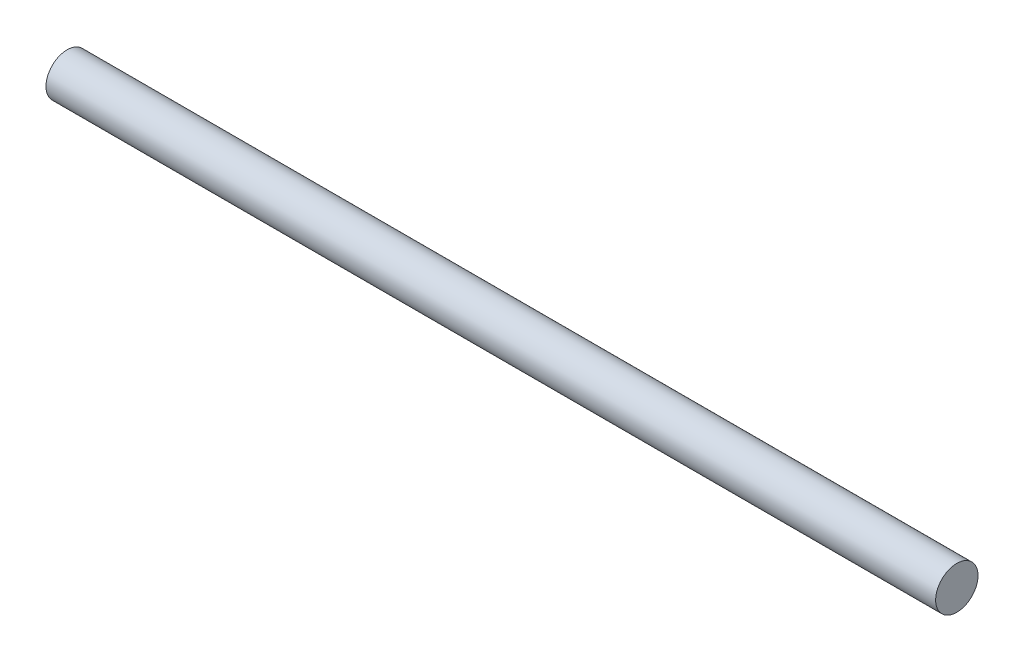
ISO-10303-21;
HEADER;
FILE_DESCRIPTION(('STEP AP214'),'2;1');
FILE_NAME('part.step','',(''),(''),'','','');
FILE_SCHEMA(('AUTOMOTIVE_DESIGN { 1 0 10303 214 1 1 1 1 }'));
ENDSEC;
DATA;
#1=APPLICATION_CONTEXT('core data for automotive mechanical design processes');
#2=APPLICATION_PROTOCOL_DEFINITION('international standard','automotive_design',2000,#1);
#3=PRODUCT_CONTEXT('',#1,'mechanical');
#4=PRODUCT('Part','Part','',(#3));
#5=PRODUCT_RELATED_PRODUCT_CATEGORY('part','',(#4));
#6=PRODUCT_DEFINITION_FORMATION('','',#4);
#7=PRODUCT_DEFINITION_CONTEXT('part definition',#1,'design');
#8=PRODUCT_DEFINITION('design','',#6,#7);
#9=PRODUCT_DEFINITION_SHAPE('','',#8);
#10=(LENGTH_UNIT() NAMED_UNIT(*) SI_UNIT(.MILLI.,.METRE.));
#11=(NAMED_UNIT(*) PLANE_ANGLE_UNIT() SI_UNIT($,.RADIAN.));
#12=(NAMED_UNIT(*) SI_UNIT($,.STERADIAN.) SOLID_ANGLE_UNIT());
#13=UNCERTAINTY_MEASURE_WITH_UNIT(LENGTH_MEASURE(1.E-05),#10,'distance_accuracy_value','');
#14=(GEOMETRIC_REPRESENTATION_CONTEXT(3) GLOBAL_UNCERTAINTY_ASSIGNED_CONTEXT((#13)) GLOBAL_UNIT_ASSIGNED_CONTEXT((#10,
#11,#12)) REPRESENTATION_CONTEXT('',''));
#15=CARTESIAN_POINT('',(0.,0.,0.));
#16=DIRECTION('',(0.,0.,1.));
#17=DIRECTION('',(1.,0.,0.));
#18=AXIS2_PLACEMENT_3D('',#15,#16,#17);
#19=CARTESIAN_POINT('',(400.,0.,0.));
#20=DIRECTION('',(-1.,0.,0.));
#21=DIRECTION('',(0.,0.,1.));
#22=AXIS2_PLACEMENT_3D('',#19,#20,#21);
#23=CYLINDRICAL_SURFACE('',#22,9.525);
#24=CARTESIAN_POINT('',(400.,0.,0.));
#25=DIRECTION('',(1.,0.,0.));
#26=DIRECTION('',(0.,0.,-1.));
#27=AXIS2_PLACEMENT_3D('',#24,#25,#26);
#28=CIRCLE('',#27,9.525);
#29=CARTESIAN_POINT('',(400.,0.,-9.525));
#30=VERTEX_POINT('',#29);
#31=EDGE_CURVE('E10',#30,#30,#28,.T.);
#32=ORIENTED_EDGE('',*,*,#31,.F.);
#33=EDGE_LOOP('',(#32));
#34=FACE_BOUND('',#33,.T.);
#35=CARTESIAN_POINT('',(0.,0.,0.));
#36=DIRECTION('',(1.,0.,0.));
#37=DIRECTION('',(0.,0.,-1.));
#38=AXIS2_PLACEMENT_3D('',#35,#36,#37);
#39=CIRCLE('',#38,9.525);
#40=CARTESIAN_POINT('',(0.,0.,-9.525));
#41=VERTEX_POINT('',#40);
#42=EDGE_CURVE('E40',#41,#41,#39,.T.);
#43=ORIENTED_EDGE('',*,*,#42,.T.);
#44=EDGE_LOOP('',(#43));
#45=FACE_BOUND('',#44,.T.);
#46=ADVANCED_FACE('F37',(#34,#45),#23,.T.);
#47=CARTESIAN_POINT('',(400.,0.,0.));
#48=DIRECTION('',(1.,0.,0.));
#49=DIRECTION('',(0.,0.,-1.));
#50=AXIS2_PLACEMENT_3D('',#47,#48,#49);
#51=PLANE('',#50);
#52=ORIENTED_EDGE('',*,*,#31,.T.);
#53=EDGE_LOOP('',(#52));
#54=FACE_BOUND('',#53,.T.);
#55=ADVANCED_FACE('F70',(#54),#51,.T.);
#56=CARTESIAN_POINT('',(0.,0.,0.));
#57=DIRECTION('',(1.,0.,0.));
#58=DIRECTION('',(0.,0.,-1.));
#59=AXIS2_PLACEMENT_3D('',#56,#57,#58);
#60=PLANE('',#59);
#61=CARTESIAN_POINT('',(0.,0.,0.));
#62=DIRECTION('',(-1.,0.,0.));
#63=DIRECTION('',(0.,0.,1.));
#64=AXIS2_PLACEMENT_3D('',#61,#62,#63);
#65=CIRCLE('',#64,4.7625);
#66=CARTESIAN_POINT('',(0.,0.,4.7625));
#67=VERTEX_POINT('',#66);
#68=EDGE_CURVE('E51',#67,#67,#65,.T.);
#69=ORIENTED_EDGE('',*,*,#68,.F.);
#70=EDGE_LOOP('',(#69));
#71=FACE_BOUND('',#70,.T.);
#72=ORIENTED_EDGE('',*,*,#42,.F.);
#73=EDGE_LOOP('',(#72));
#74=FACE_BOUND('',#73,.T.);
#75=ADVANCED_FACE('F64',(#71,#74),#60,.F.);
#76=CARTESIAN_POINT('',(30.,0.,0.));
#77=DIRECTION('',(-1.,0.,0.));
#78=DIRECTION('',(0.,0.,1.));
#79=AXIS2_PLACEMENT_3D('',#76,#77,#78);
#80=CYLINDRICAL_SURFACE('',#79,4.7625);
#81=CARTESIAN_POINT('',(30.,0.,0.));
#82=DIRECTION('',(-1.,0.,0.));
#83=DIRECTION('',(0.,0.,1.));
#84=AXIS2_PLACEMENT_3D('',#81,#82,#83);
#85=CIRCLE('',#84,4.7625);
#86=CARTESIAN_POINT('',(30.,0.,4.7625));
#87=VERTEX_POINT('',#86);
#88=EDGE_CURVE('E49',#87,#87,#85,.T.);
#89=ORIENTED_EDGE('',*,*,#88,.F.);
#90=EDGE_LOOP('',(#89));
#91=FACE_BOUND('',#90,.T.);
#92=ORIENTED_EDGE('',*,*,#68,.T.);
#93=EDGE_LOOP('',(#92));
#94=FACE_BOUND('',#93,.T.);
#95=ADVANCED_FACE('F61',(#91,#94),#80,.F.);
#96=CARTESIAN_POINT('',(30.,0.,0.));
#97=DIRECTION('',(-1.,0.,0.));
#98=DIRECTION('',(0.,0.,1.));
#99=AXIS2_PLACEMENT_3D('',#96,#97,#98);
#100=PLANE('',#99);
#101=ORIENTED_EDGE('',*,*,#88,.T.);
#102=EDGE_LOOP('',(#101));
#103=FACE_BOUND('',#102,.T.);
#104=ADVANCED_FACE('F59',(#103),#100,.T.);
#105=CLOSED_SHELL('',(#46,#55,#75,#95,#104));
#106=MANIFOLD_SOLID_BREP('B2',#105);
#107=ADVANCED_BREP_SHAPE_REPRESENTATION('',(#18,#106),#14);
#108=SHAPE_DEFINITION_REPRESENTATION(#9,#107);
ENDSEC;
END-ISO-10303-21;
